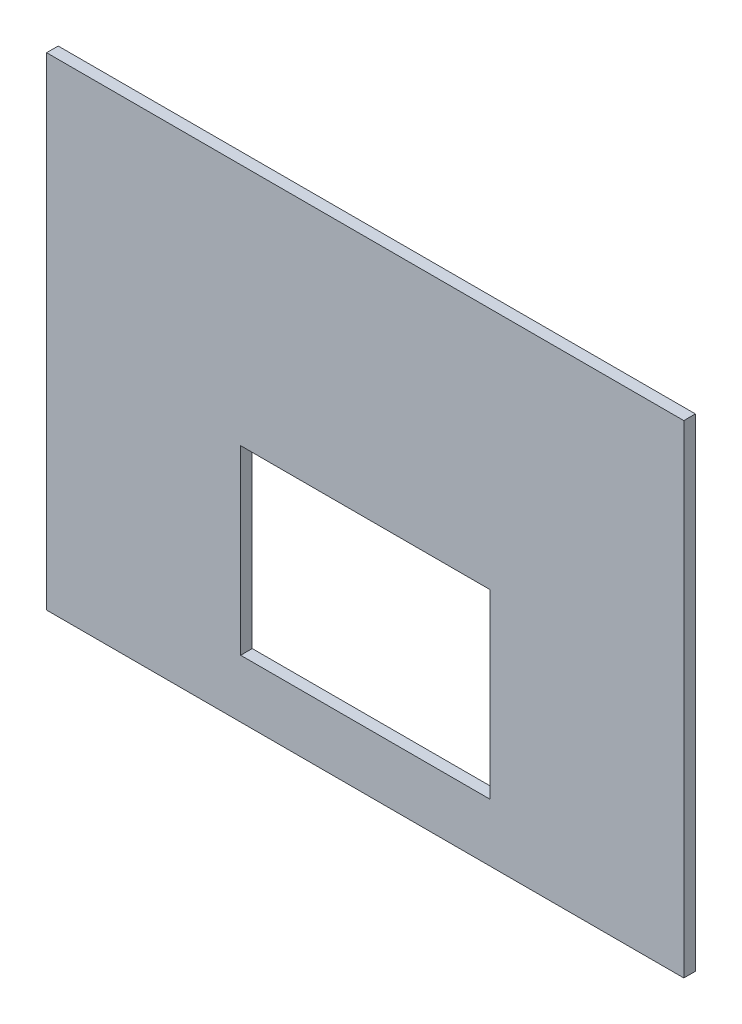
ISO-10303-21;
HEADER;
FILE_DESCRIPTION(('STEP AP214'),'2;1');
FILE_NAME('part.step','',(''),(''),'','','');
FILE_SCHEMA(('AUTOMOTIVE_DESIGN { 1 0 10303 214 1 1 1 1 }'));
ENDSEC;
DATA;
#1=APPLICATION_CONTEXT('core data for automotive mechanical design processes');
#2=APPLICATION_PROTOCOL_DEFINITION('international standard','automotive_design',2000,#1);
#3=PRODUCT_CONTEXT('',#1,'mechanical');
#4=PRODUCT('Part','Part','',(#3));
#5=PRODUCT_RELATED_PRODUCT_CATEGORY('part','',(#4));
#6=PRODUCT_DEFINITION_FORMATION('','',#4);
#7=PRODUCT_DEFINITION_CONTEXT('part definition',#1,'design');
#8=PRODUCT_DEFINITION('design','',#6,#7);
#9=PRODUCT_DEFINITION_SHAPE('','',#8);
#10=(LENGTH_UNIT() NAMED_UNIT(*) SI_UNIT(.MILLI.,.METRE.));
#11=(NAMED_UNIT(*) PLANE_ANGLE_UNIT() SI_UNIT($,.RADIAN.));
#12=(NAMED_UNIT(*) SI_UNIT($,.STERADIAN.) SOLID_ANGLE_UNIT());
#13=UNCERTAINTY_MEASURE_WITH_UNIT(LENGTH_MEASURE(1.E-05),#10,'distance_accuracy_value','');
#14=(GEOMETRIC_REPRESENTATION_CONTEXT(3) GLOBAL_UNCERTAINTY_ASSIGNED_CONTEXT((#13)) GLOBAL_UNIT_ASSIGNED_CONTEXT((#10,
#11,#12)) REPRESENTATION_CONTEXT('',''));
#15=CARTESIAN_POINT('',(0.,0.,0.));
#16=DIRECTION('',(0.,0.,1.));
#17=DIRECTION('',(1.,0.,0.));
#18=AXIS2_PLACEMENT_3D('',#15,#16,#17);
#19=CARTESIAN_POINT('',(0.,0.,6.));
#20=DIRECTION('',(0.,0.,1.));
#21=DIRECTION('',(1.,0.,0.));
#22=AXIS2_PLACEMENT_3D('',#19,#20,#21);
#23=PLANE('',#22);
#24=DIRECTION('',(0.,-1.,0.));
#25=VECTOR('',#24,1.);
#26=CARTESIAN_POINT('',(-129.236308677098,197.899931007589,6.));
#27=LINE('',#26,#25);
#28=CARTESIAN_POINT('',(-129.236308677098,197.899931007589,6.));
#29=VERTEX_POINT('',#28);
#30=CARTESIAN_POINT('',(-129.236308677098,-52.1000689924117,6.));
#31=VERTEX_POINT('',#30);
#32=EDGE_CURVE('E134',#29,#31,#27,.T.);
#33=ORIENTED_EDGE('',*,*,#32,.T.);
#34=DIRECTION('',(1.,0.,0.));
#35=VECTOR('',#34,1.);
#36=CARTESIAN_POINT('',(-129.236308677098,-52.1000689924117,6.));
#37=LINE('',#36,#35);
#38=CARTESIAN_POINT('',(200.763691322902,-52.1000689924119,6.));
#39=VERTEX_POINT('',#38);
#40=EDGE_CURVE('E137',#31,#39,#37,.T.);
#41=ORIENTED_EDGE('',*,*,#40,.T.);
#42=DIRECTION('',(0.,1.,0.));
#43=VECTOR('',#42,1.);
#44=CARTESIAN_POINT('',(200.763691322902,197.899931007589,6.));
#45=LINE('',#44,#43);
#46=CARTESIAN_POINT('',(200.763691322902,197.899931007589,6.));
#47=VERTEX_POINT('',#46);
#48=EDGE_CURVE('E140',#39,#47,#45,.T.);
#49=ORIENTED_EDGE('',*,*,#48,.T.);
#50=DIRECTION('',(-1.,0.,0.));
#51=VECTOR('',#50,1.);
#52=CARTESIAN_POINT('',(-129.236308677098,197.899931007589,6.));
#53=LINE('',#52,#51);
#54=EDGE_CURVE('E142',#47,#29,#53,.T.);
#55=ORIENTED_EDGE('',*,*,#54,.T.);
#56=EDGE_LOOP('',(#33,#41,#49,#55));
#57=FACE_BOUND('',#56,.T.);
#58=DIRECTION('',(1.,0.,0.));
#59=VECTOR('',#58,1.);
#60=CARTESIAN_POINT('',(-28.7363086770979,-22.1000689924117,6.));
#61=LINE('',#60,#59);
#62=CARTESIAN_POINT('',(-28.7363086770979,-22.1000689924117,6.));
#63=VERTEX_POINT('',#62);
#64=CARTESIAN_POINT('',(100.263691322902,-22.1000689924117,6.));
#65=VERTEX_POINT('',#64);
#66=EDGE_CURVE('E106',#63,#65,#61,.T.);
#67=ORIENTED_EDGE('',*,*,#66,.F.);
#68=DIRECTION('',(0.,-1.,0.));
#69=VECTOR('',#68,1.);
#70=CARTESIAN_POINT('',(-28.7363086770979,71.8999310075883,6.));
#71=LINE('',#70,#69);
#72=CARTESIAN_POINT('',(-28.7363086770979,71.8999310075883,6.));
#73=VERTEX_POINT('',#72);
#74=EDGE_CURVE('E98',#73,#63,#71,.T.);
#75=ORIENTED_EDGE('',*,*,#74,.F.);
#76=DIRECTION('',(-1.,0.,0.));
#77=VECTOR('',#76,1.);
#78=CARTESIAN_POINT('',(-28.7363086770979,71.8999310075883,6.));
#79=LINE('',#78,#77);
#80=CARTESIAN_POINT('',(100.263691322902,71.8999310075883,6.));
#81=VERTEX_POINT('',#80);
#82=EDGE_CURVE('E120',#81,#73,#79,.T.);
#83=ORIENTED_EDGE('',*,*,#82,.F.);
#84=DIRECTION('',(0.,1.,0.));
#85=VECTOR('',#84,1.);
#86=CARTESIAN_POINT('',(100.263691322902,71.8999310075883,6.));
#87=LINE('',#86,#85);
#88=EDGE_CURVE('E118',#65,#81,#87,.T.);
#89=ORIENTED_EDGE('',*,*,#88,.F.);
#90=EDGE_LOOP('',(#67,#75,#83,#89));
#91=FACE_BOUND('',#90,.T.);
#92=ADVANCED_FACE('F33',(#57,#91),#23,.T.);
#93=CARTESIAN_POINT('',(0.,0.,0.));
#94=DIRECTION('',(0.,0.,1.));
#95=DIRECTION('',(1.,0.,0.));
#96=AXIS2_PLACEMENT_3D('',#93,#94,#95);
#97=PLANE('',#96);
#98=DIRECTION('',(0.,-1.,0.));
#99=VECTOR('',#98,1.);
#100=CARTESIAN_POINT('',(-129.236308677098,197.899931007589,0.));
#101=LINE('',#100,#99);
#102=CARTESIAN_POINT('',(-129.236308677098,197.899931007589,0.));
#103=VERTEX_POINT('',#102);
#104=CARTESIAN_POINT('',(-129.236308677098,-52.1000689924117,0.));
#105=VERTEX_POINT('',#104);
#106=EDGE_CURVE('E114',#103,#105,#101,.T.);
#107=ORIENTED_EDGE('',*,*,#106,.F.);
#108=DIRECTION('',(-1.,0.,0.));
#109=VECTOR('',#108,1.);
#110=CARTESIAN_POINT('',(-129.236308677098,197.899931007589,0.));
#111=LINE('',#110,#109);
#112=CARTESIAN_POINT('',(200.763691322902,197.899931007589,0.));
#113=VERTEX_POINT('',#112);
#114=EDGE_CURVE('E138',#113,#103,#111,.T.);
#115=ORIENTED_EDGE('',*,*,#114,.F.);
#116=DIRECTION('',(0.,1.,0.));
#117=VECTOR('',#116,1.);
#118=CARTESIAN_POINT('',(200.763691322902,197.899931007589,0.));
#119=LINE('',#118,#117);
#120=CARTESIAN_POINT('',(200.763691322902,-52.1000689924119,0.));
#121=VERTEX_POINT('',#120);
#122=EDGE_CURVE('E149',#121,#113,#119,.T.);
#123=ORIENTED_EDGE('',*,*,#122,.F.);
#124=DIRECTION('',(1.,0.,0.));
#125=VECTOR('',#124,1.);
#126=CARTESIAN_POINT('',(-129.236308677098,-52.1000689924117,0.));
#127=LINE('',#126,#125);
#128=EDGE_CURVE('E147',#105,#121,#127,.T.);
#129=ORIENTED_EDGE('',*,*,#128,.F.);
#130=EDGE_LOOP('',(#107,#115,#123,#129));
#131=FACE_BOUND('',#130,.T.);
#132=DIRECTION('',(0.,-1.,0.));
#133=VECTOR('',#132,1.);
#134=CARTESIAN_POINT('',(-28.7363086770979,71.8999310075883,0.));
#135=LINE('',#134,#133);
#136=CARTESIAN_POINT('',(-28.7363086770979,71.8999310075883,0.));
#137=VERTEX_POINT('',#136);
#138=CARTESIAN_POINT('',(-28.7363086770979,-22.1000689924117,0.));
#139=VERTEX_POINT('',#138);
#140=EDGE_CURVE('E56',#137,#139,#135,.T.);
#141=ORIENTED_EDGE('',*,*,#140,.T.);
#142=DIRECTION('',(1.,0.,0.));
#143=VECTOR('',#142,1.);
#144=CARTESIAN_POINT('',(-28.7363086770979,-22.1000689924117,0.));
#145=LINE('',#144,#143);
#146=CARTESIAN_POINT('',(100.263691322902,-22.1000689924117,0.));
#147=VERTEX_POINT('',#146);
#148=EDGE_CURVE('E113',#139,#147,#145,.T.);
#149=ORIENTED_EDGE('',*,*,#148,.T.);
#150=DIRECTION('',(0.,1.,0.));
#151=VECTOR('',#150,1.);
#152=CARTESIAN_POINT('',(100.263691322902,71.8999310075883,0.));
#153=LINE('',#152,#151);
#154=CARTESIAN_POINT('',(100.263691322902,71.8999310075883,0.));
#155=VERTEX_POINT('',#154);
#156=EDGE_CURVE('E126',#147,#155,#153,.T.);
#157=ORIENTED_EDGE('',*,*,#156,.T.);
#158=DIRECTION('',(-1.,0.,0.));
#159=VECTOR('',#158,1.);
#160=CARTESIAN_POINT('',(-28.7363086770979,71.8999310075883,0.));
#161=LINE('',#160,#159);
#162=EDGE_CURVE('E107',#155,#137,#161,.T.);
#163=ORIENTED_EDGE('',*,*,#162,.T.);
#164=EDGE_LOOP('',(#141,#149,#157,#163));
#165=FACE_BOUND('',#164,.T.);
#166=ADVANCED_FACE('F167',(#131,#165),#97,.F.);
#167=CARTESIAN_POINT('',(-129.236308677098,197.899931007589,6.));
#168=DIRECTION('',(1.,0.,0.));
#169=DIRECTION('',(0.,1.,0.));
#170=AXIS2_PLACEMENT_3D('',#167,#168,#169);
#171=PLANE('',#170);
#172=ORIENTED_EDGE('',*,*,#106,.T.);
#173=DIRECTION('',(0.,0.,-1.));
#174=VECTOR('',#173,1.);
#175=CARTESIAN_POINT('',(-129.236308677098,-52.1000689924117,6.));
#176=LINE('',#175,#174);
#177=EDGE_CURVE('E11',#31,#105,#176,.T.);
#178=ORIENTED_EDGE('',*,*,#177,.F.);
#179=ORIENTED_EDGE('',*,*,#32,.F.);
#180=DIRECTION('',(0.,0.,-1.));
#181=VECTOR('',#180,1.);
#182=CARTESIAN_POINT('',(-129.236308677098,197.899931007589,6.));
#183=LINE('',#182,#181);
#184=EDGE_CURVE('E144',#29,#103,#183,.T.);
#185=ORIENTED_EDGE('',*,*,#184,.T.);
#186=EDGE_LOOP('',(#172,#178,#179,#185));
#187=FACE_BOUND('',#186,.T.);
#188=ADVANCED_FACE('F35',(#187),#171,.F.);
#189=CARTESIAN_POINT('',(-129.236308677098,-52.1000689924117,6.));
#190=DIRECTION('',(0.,1.,0.));
#191=DIRECTION('',(-1.,0.,0.));
#192=AXIS2_PLACEMENT_3D('',#189,#190,#191);
#193=PLANE('',#192);
#194=ORIENTED_EDGE('',*,*,#128,.T.);
#195=DIRECTION('',(0.,0.,-1.));
#196=VECTOR('',#195,1.);
#197=CARTESIAN_POINT('',(200.763691322902,-52.1000689924119,6.));
#198=LINE('',#197,#196);
#199=EDGE_CURVE('E41',#39,#121,#198,.T.);
#200=ORIENTED_EDGE('',*,*,#199,.F.);
#201=ORIENTED_EDGE('',*,*,#40,.F.);
#202=ORIENTED_EDGE('',*,*,#177,.T.);
#203=EDGE_LOOP('',(#194,#200,#201,#202));
#204=FACE_BOUND('',#203,.T.);
#205=ADVANCED_FACE('F177',(#204),#193,.F.);
#206=CARTESIAN_POINT('',(200.763691322902,197.899931007589,6.));
#207=DIRECTION('',(-1.,0.,0.));
#208=DIRECTION('',(0.,-1.,0.));
#209=AXIS2_PLACEMENT_3D('',#206,#207,#208);
#210=PLANE('',#209);
#211=ORIENTED_EDGE('',*,*,#122,.T.);
#212=DIRECTION('',(0.,0.,-1.));
#213=VECTOR('',#212,1.);
#214=CARTESIAN_POINT('',(200.763691322902,197.899931007589,6.));
#215=LINE('',#214,#213);
#216=EDGE_CURVE('E154',#47,#113,#215,.T.);
#217=ORIENTED_EDGE('',*,*,#216,.F.);
#218=ORIENTED_EDGE('',*,*,#48,.F.);
#219=ORIENTED_EDGE('',*,*,#199,.T.);
#220=EDGE_LOOP('',(#211,#217,#218,#219));
#221=FACE_BOUND('',#220,.T.);
#222=ADVANCED_FACE('F161',(#221),#210,.F.);
#223=CARTESIAN_POINT('',(-129.236308677098,197.899931007589,6.));
#224=DIRECTION('',(0.,-1.,0.));
#225=DIRECTION('',(0.,0.,-1.));
#226=AXIS2_PLACEMENT_3D('',#223,#224,#225);
#227=PLANE('',#226);
#228=ORIENTED_EDGE('',*,*,#114,.T.);
#229=ORIENTED_EDGE('',*,*,#184,.F.);
#230=ORIENTED_EDGE('',*,*,#54,.F.);
#231=ORIENTED_EDGE('',*,*,#216,.T.);
#232=EDGE_LOOP('',(#228,#229,#230,#231));
#233=FACE_BOUND('',#232,.T.);
#234=ADVANCED_FACE('F171',(#233),#227,.F.);
#235=CARTESIAN_POINT('',(-28.7363086770979,71.8999310075883,6.));
#236=DIRECTION('',(1.,0.,0.));
#237=DIRECTION('',(0.,1.,0.));
#238=AXIS2_PLACEMENT_3D('',#235,#236,#237);
#239=PLANE('',#238);
#240=ORIENTED_EDGE('',*,*,#140,.F.);
#241=DIRECTION('',(0.,0.,-1.));
#242=VECTOR('',#241,1.);
#243=CARTESIAN_POINT('',(-28.7363086770979,71.8999310075883,6.));
#244=LINE('',#243,#242);
#245=EDGE_CURVE('E102',#73,#137,#244,.T.);
#246=ORIENTED_EDGE('',*,*,#245,.F.);
#247=ORIENTED_EDGE('',*,*,#74,.T.);
#248=DIRECTION('',(0.,0.,-1.));
#249=VECTOR('',#248,1.);
#250=CARTESIAN_POINT('',(-28.7363086770979,-22.1000689924117,6.));
#251=LINE('',#250,#249);
#252=EDGE_CURVE('E101',#63,#139,#251,.T.);
#253=ORIENTED_EDGE('',*,*,#252,.T.);
#254=EDGE_LOOP('',(#240,#246,#247,#253));
#255=FACE_BOUND('',#254,.T.);
#256=ADVANCED_FACE('F100',(#255),#239,.T.);
#257=CARTESIAN_POINT('',(-28.7363086770979,-22.1000689924117,6.));
#258=DIRECTION('',(0.,1.,0.));
#259=DIRECTION('',(0.,0.,1.));
#260=AXIS2_PLACEMENT_3D('',#257,#258,#259);
#261=PLANE('',#260);
#262=ORIENTED_EDGE('',*,*,#148,.F.);
#263=ORIENTED_EDGE('',*,*,#252,.F.);
#264=ORIENTED_EDGE('',*,*,#66,.T.);
#265=DIRECTION('',(0.,0.,-1.));
#266=VECTOR('',#265,1.);
#267=CARTESIAN_POINT('',(100.263691322902,-22.1000689924117,6.));
#268=LINE('',#267,#266);
#269=EDGE_CURVE('E115',#65,#147,#268,.T.);
#270=ORIENTED_EDGE('',*,*,#269,.T.);
#271=EDGE_LOOP('',(#262,#263,#264,#270));
#272=FACE_BOUND('',#271,.T.);
#273=ADVANCED_FACE('F110',(#272),#261,.T.);
#274=CARTESIAN_POINT('',(100.263691322902,71.8999310075883,6.));
#275=DIRECTION('',(-1.,0.,0.));
#276=DIRECTION('',(0.,-1.,0.));
#277=AXIS2_PLACEMENT_3D('',#274,#275,#276);
#278=PLANE('',#277);
#279=ORIENTED_EDGE('',*,*,#156,.F.);
#280=ORIENTED_EDGE('',*,*,#269,.F.);
#281=ORIENTED_EDGE('',*,*,#88,.T.);
#282=DIRECTION('',(0.,0.,-1.));
#283=VECTOR('',#282,1.);
#284=CARTESIAN_POINT('',(100.263691322902,71.8999310075883,6.));
#285=LINE('',#284,#283);
#286=EDGE_CURVE('E48',#81,#155,#285,.T.);
#287=ORIENTED_EDGE('',*,*,#286,.T.);
#288=EDGE_LOOP('',(#279,#280,#281,#287));
#289=FACE_BOUND('',#288,.T.);
#290=ADVANCED_FACE('F200',(#289),#278,.T.);
#291=CARTESIAN_POINT('',(-28.7363086770979,71.8999310075883,6.));
#292=DIRECTION('',(0.,-1.,0.));
#293=DIRECTION('',(1.,0.,0.));
#294=AXIS2_PLACEMENT_3D('',#291,#292,#293);
#295=PLANE('',#294);
#296=ORIENTED_EDGE('',*,*,#162,.F.);
#297=ORIENTED_EDGE('',*,*,#286,.F.);
#298=ORIENTED_EDGE('',*,*,#82,.T.);
#299=ORIENTED_EDGE('',*,*,#245,.T.);
#300=EDGE_LOOP('',(#296,#297,#298,#299));
#301=FACE_BOUND('',#300,.T.);
#302=ADVANCED_FACE('F204',(#301),#295,.T.);
#303=CLOSED_SHELL('',(#92,#166,#188,#205,#222,#234,#256,#273,#290,#302));
#304=MANIFOLD_SOLID_BREP('B2',#303);
#305=ADVANCED_BREP_SHAPE_REPRESENTATION('',(#18,#304),#14);
#306=SHAPE_DEFINITION_REPRESENTATION(#9,#305);
ENDSEC;
END-ISO-10303-21;
